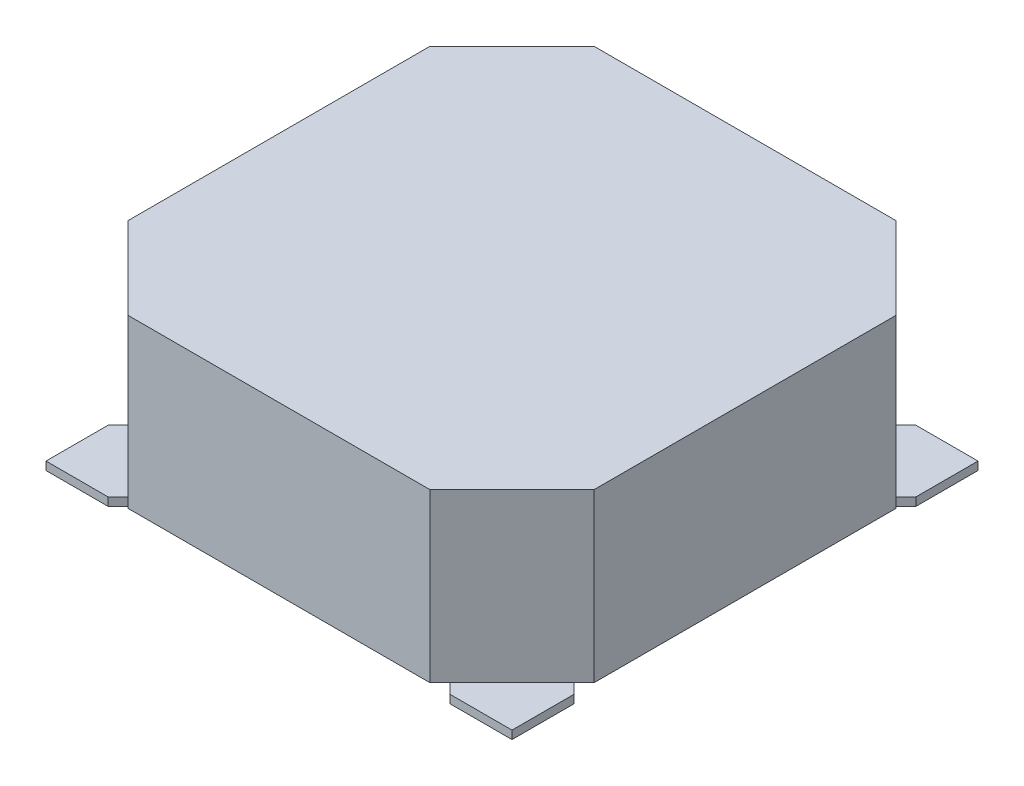
ISO-10303-21;
HEADER;
FILE_DESCRIPTION(('STEP AP214'),'2;1');
FILE_NAME('part.step','',(''),(''),'','','');
FILE_SCHEMA(('AUTOMOTIVE_DESIGN { 1 0 10303 214 1 1 1 1 }'));
ENDSEC;
DATA;
#1=APPLICATION_CONTEXT('core data for automotive mechanical design processes');
#2=APPLICATION_PROTOCOL_DEFINITION('international standard','automotive_design',2000,#1);
#3=PRODUCT_CONTEXT('',#1,'mechanical');
#4=PRODUCT('Part','Part','',(#3));
#5=PRODUCT_RELATED_PRODUCT_CATEGORY('part','',(#4));
#6=PRODUCT_DEFINITION_FORMATION('','',#4);
#7=PRODUCT_DEFINITION_CONTEXT('part definition',#1,'design');
#8=PRODUCT_DEFINITION('design','',#6,#7);
#9=PRODUCT_DEFINITION_SHAPE('','',#8);
#10=(LENGTH_UNIT() NAMED_UNIT(*) SI_UNIT(.MILLI.,.METRE.));
#11=(NAMED_UNIT(*) PLANE_ANGLE_UNIT() SI_UNIT($,.RADIAN.));
#12=(NAMED_UNIT(*) SI_UNIT($,.STERADIAN.) SOLID_ANGLE_UNIT());
#13=UNCERTAINTY_MEASURE_WITH_UNIT(LENGTH_MEASURE(1.E-05),#10,'distance_accuracy_value','');
#14=(GEOMETRIC_REPRESENTATION_CONTEXT(3) GLOBAL_UNCERTAINTY_ASSIGNED_CONTEXT((#13)) GLOBAL_UNIT_ASSIGNED_CONTEXT((#10,
#11,#12)) REPRESENTATION_CONTEXT('',''));
#15=CARTESIAN_POINT('',(0.,0.,0.));
#16=DIRECTION('',(0.,0.,1.));
#17=DIRECTION('',(1.,0.,0.));
#18=AXIS2_PLACEMENT_3D('',#15,#16,#17);
#19=CARTESIAN_POINT('',(0.,3.2,0.));
#20=DIRECTION('',(1.,0.,0.));
#21=DIRECTION('',(0.,0.,-1.));
#22=AXIS2_PLACEMENT_3D('',#19,#20,#21);
#23=PLANE('',#22);
#24=DIRECTION('',(0.,1.,0.));
#25=VECTOR('',#24,1.);
#26=CARTESIAN_POINT('',(0.,0.15,1.5));
#27=LINE('',#26,#25);
#28=CARTESIAN_POINT('',(0.,0.150000000000001,1.5));
#29=VERTEX_POINT('',#28);
#30=CARTESIAN_POINT('',(0.,3.2,1.5));
#31=VERTEX_POINT('',#30);
#32=EDGE_CURVE('E294',#29,#31,#27,.T.);
#33=ORIENTED_EDGE('',*,*,#32,.F.);
#34=DIRECTION('',(0.,0.,-1.));
#35=VECTOR('',#34,1.);
#36=CARTESIAN_POINT('',(0.,0.150000000000001,1.13137084989849));
#37=LINE('',#36,#35);
#38=CARTESIAN_POINT('',(0.,0.150000000000001,7.));
#39=VERTEX_POINT('',#38);
#40=EDGE_CURVE('E443',#39,#29,#37,.T.);
#41=ORIENTED_EDGE('',*,*,#40,.F.);
#42=DIRECTION('',(0.,1.,0.));
#43=VECTOR('',#42,1.);
#44=CARTESIAN_POINT('',(0.,0.15,7.));
#45=LINE('',#44,#43);
#46=CARTESIAN_POINT('',(0.,3.2,7.));
#47=VERTEX_POINT('',#46);
#48=EDGE_CURVE('E338',#39,#47,#45,.T.);
#49=ORIENTED_EDGE('',*,*,#48,.T.);
#50=DIRECTION('',(0.,0.,1.));
#51=VECTOR('',#50,1.);
#52=CARTESIAN_POINT('',(0.,3.2,0.));
#53=LINE('',#52,#51);
#54=EDGE_CURVE('E346',#31,#47,#53,.T.);
#55=ORIENTED_EDGE('',*,*,#54,.F.);
#56=EDGE_LOOP('',(#33,#41,#49,#55));
#57=FACE_BOUND('',#56,.T.);
#58=ADVANCED_FACE('F32',(#57),#23,.F.);
#59=DIRECTION('',(0.,0.,1.));
#60=VECTOR('',#59,1.);
#61=CARTESIAN_POINT('',(0.,0.15,0.));
#62=LINE('',#61,#60);
#63=CARTESIAN_POINT('',(0.,0.150000000000001,7.36862915010156));
#64=VERTEX_POINT('',#63);
#65=CARTESIAN_POINT('',(0.,0.15,8.5));
#66=VERTEX_POINT('',#65);
#67=EDGE_CURVE('E332',#64,#66,#62,.T.);
#68=ORIENTED_EDGE('',*,*,#67,.F.);
#69=DIRECTION('',(0.,-1.,0.));
#70=VECTOR('',#69,1.);
#71=CARTESIAN_POINT('',(0.,12.1708152801714,7.36862915010156));
#72=LINE('',#71,#70);
#73=CARTESIAN_POINT('',(0.,0.,7.36862915010156));
#74=VERTEX_POINT('',#73);
#75=EDGE_CURVE('E446',#64,#74,#72,.T.);
#76=ORIENTED_EDGE('',*,*,#75,.T.);
#77=DIRECTION('',(0.,0.,1.));
#78=VECTOR('',#77,1.);
#79=CARTESIAN_POINT('',(0.,0.,0.));
#80=LINE('',#79,#78);
#81=CARTESIAN_POINT('',(0.,0.,8.5));
#82=VERTEX_POINT('',#81);
#83=EDGE_CURVE('E343',#74,#82,#80,.T.);
#84=ORIENTED_EDGE('',*,*,#83,.T.);
#85=DIRECTION('',(0.,-1.,0.));
#86=VECTOR('',#85,1.);
#87=CARTESIAN_POINT('',(0.,3.2,8.5));
#88=LINE('',#87,#86);
#89=EDGE_CURVE('E40',#66,#82,#88,.T.);
#90=ORIENTED_EDGE('',*,*,#89,.F.);
#91=EDGE_LOOP('',(#68,#76,#84,#90));
#92=FACE_BOUND('',#91,.T.);
#93=ADVANCED_FACE('F528',(#92),#23,.F.);
#94=CARTESIAN_POINT('',(0.,3.2,8.5));
#95=DIRECTION('',(0.,0.,-1.));
#96=DIRECTION('',(-1.,0.,0.));
#97=AXIS2_PLACEMENT_3D('',#94,#95,#96);
#98=PLANE('',#97);
#99=DIRECTION('',(0.,1.,0.));
#100=VECTOR('',#99,1.);
#101=CARTESIAN_POINT('',(1.5,0.15,8.5));
#102=LINE('',#101,#100);
#103=CARTESIAN_POINT('',(1.5,0.150000000000001,8.50000000000002));
#104=VERTEX_POINT('',#103);
#105=CARTESIAN_POINT('',(1.5,3.2,8.5));
#106=VERTEX_POINT('',#105);
#107=EDGE_CURVE('E341',#104,#106,#102,.T.);
#108=ORIENTED_EDGE('',*,*,#107,.F.);
#109=DIRECTION('',(-1.,0.,0.));
#110=VECTOR('',#109,1.);
#111=CARTESIAN_POINT('',(1.13137084989851,0.150000000000001,8.50000000000002));
#112=LINE('',#111,#110);
#113=CARTESIAN_POINT('',(7.,0.150000000000001,8.49999999999998));
#114=VERTEX_POINT('',#113);
#115=EDGE_CURVE('E460',#114,#104,#112,.T.);
#116=ORIENTED_EDGE('',*,*,#115,.F.);
#117=DIRECTION('',(0.,1.,0.));
#118=VECTOR('',#117,1.);
#119=CARTESIAN_POINT('',(7.,0.15,8.5));
#120=LINE('',#119,#118);
#121=CARTESIAN_POINT('',(7.,3.2,8.5));
#122=VERTEX_POINT('',#121);
#123=EDGE_CURVE('E323',#114,#122,#120,.T.);
#124=ORIENTED_EDGE('',*,*,#123,.T.);
#125=DIRECTION('',(1.,0.,0.));
#126=VECTOR('',#125,1.);
#127=CARTESIAN_POINT('',(0.,3.2,8.5));
#128=LINE('',#127,#126);
#129=EDGE_CURVE('E348',#106,#122,#128,.T.);
#130=ORIENTED_EDGE('',*,*,#129,.F.);
#131=EDGE_LOOP('',(#108,#116,#124,#130));
#132=FACE_BOUND('',#131,.T.);
#133=ADVANCED_FACE('F501',(#132),#98,.F.);
#134=DIRECTION('',(1.,0.,0.));
#135=VECTOR('',#134,1.);
#136=CARTESIAN_POINT('',(0.,0.15,8.5));
#137=LINE('',#136,#135);
#138=CARTESIAN_POINT('',(7.36862915010158,0.15,8.5));
#139=VERTEX_POINT('',#138);
#140=CARTESIAN_POINT('',(8.5,0.15,8.5));
#141=VERTEX_POINT('',#140);
#142=EDGE_CURVE('E53',#139,#141,#137,.T.);
#143=ORIENTED_EDGE('',*,*,#142,.F.);
#144=DIRECTION('',(0.,-1.,0.));
#145=VECTOR('',#144,1.);
#146=CARTESIAN_POINT('',(7.36862915010158,12.1708152801714,8.49999999999997));
#147=LINE('',#146,#145);
#148=CARTESIAN_POINT('',(7.36862915010158,0.,8.49999999999997));
#149=VERTEX_POINT('',#148);
#150=EDGE_CURVE('E46',#139,#149,#147,.T.);
#151=ORIENTED_EDGE('',*,*,#150,.T.);
#152=DIRECTION('',(1.,0.,0.));
#153=VECTOR('',#152,1.);
#154=CARTESIAN_POINT('',(0.,0.,8.5));
#155=LINE('',#154,#153);
#156=CARTESIAN_POINT('',(8.5,0.,8.5));
#157=VERTEX_POINT('',#156);
#158=EDGE_CURVE('E362',#149,#157,#155,.T.);
#159=ORIENTED_EDGE('',*,*,#158,.T.);
#160=DIRECTION('',(0.,-1.,0.));
#161=VECTOR('',#160,1.);
#162=CARTESIAN_POINT('',(8.5,3.2,8.5));
#163=LINE('',#162,#161);
#164=EDGE_CURVE('E378',#141,#157,#163,.T.);
#165=ORIENTED_EDGE('',*,*,#164,.F.);
#166=EDGE_LOOP('',(#143,#151,#159,#165));
#167=FACE_BOUND('',#166,.T.);
#168=ADVANCED_FACE('F481',(#167),#98,.F.);
#169=CARTESIAN_POINT('',(8.5,3.2,0.));
#170=DIRECTION('',(-1.,0.,0.));
#171=DIRECTION('',(0.,0.,1.));
#172=AXIS2_PLACEMENT_3D('',#169,#170,#171);
#173=PLANE('',#172);
#174=DIRECTION('',(0.,1.,0.));
#175=VECTOR('',#174,1.);
#176=CARTESIAN_POINT('',(8.5,0.15,7.));
#177=LINE('',#176,#175);
#178=CARTESIAN_POINT('',(8.50000000000003,0.150000000000001,7.));
#179=VERTEX_POINT('',#178);
#180=CARTESIAN_POINT('',(8.5,3.2,7.));
#181=VERTEX_POINT('',#180);
#182=EDGE_CURVE('E312',#179,#181,#177,.T.);
#183=ORIENTED_EDGE('',*,*,#182,.F.);
#184=DIRECTION('',(0.,0.,1.));
#185=VECTOR('',#184,1.);
#186=CARTESIAN_POINT('',(8.50000000000003,0.150000000000001,7.36862915010148));
#187=LINE('',#186,#185);
#188=CARTESIAN_POINT('',(8.50000000000001,0.150000000000001,1.5));
#189=VERTEX_POINT('',#188);
#190=EDGE_CURVE('E273',#189,#179,#187,.T.);
#191=ORIENTED_EDGE('',*,*,#190,.F.);
#192=DIRECTION('',(0.,1.,0.));
#193=VECTOR('',#192,1.);
#194=CARTESIAN_POINT('',(8.5,0.15,1.5));
#195=LINE('',#194,#193);
#196=CARTESIAN_POINT('',(8.5,3.2,1.5));
#197=VERTEX_POINT('',#196);
#198=EDGE_CURVE('E308',#189,#197,#195,.T.);
#199=ORIENTED_EDGE('',*,*,#198,.T.);
#200=DIRECTION('',(0.,0.,-1.));
#201=VECTOR('',#200,1.);
#202=CARTESIAN_POINT('',(8.5,3.2,0.));
#203=LINE('',#202,#201);
#204=EDGE_CURVE('E352',#181,#197,#203,.T.);
#205=ORIENTED_EDGE('',*,*,#204,.F.);
#206=EDGE_LOOP('',(#183,#191,#199,#205));
#207=FACE_BOUND('',#206,.T.);
#208=ADVANCED_FACE('F662',(#207),#173,.F.);
#209=DIRECTION('',(0.,0.,-1.));
#210=VECTOR('',#209,1.);
#211=CARTESIAN_POINT('',(8.5,0.,0.));
#212=LINE('',#211,#210);
#213=CARTESIAN_POINT('',(8.50000000000003,0.,7.36862915010148));
#214=VERTEX_POINT('',#213);
#215=EDGE_CURVE('E367',#157,#214,#212,.T.);
#216=ORIENTED_EDGE('',*,*,#215,.T.);
#217=DIRECTION('',(0.,-1.,0.));
#218=VECTOR('',#217,1.);
#219=CARTESIAN_POINT('',(8.50000000000003,12.1708152801714,7.36862915010148));
#220=LINE('',#219,#218);
#221=CARTESIAN_POINT('',(8.50000000000003,0.150000000000001,7.36862915010148));
#222=VERTEX_POINT('',#221);
#223=EDGE_CURVE('E270',#222,#214,#220,.T.);
#224=ORIENTED_EDGE('',*,*,#223,.F.);
#225=DIRECTION('',(0.,0.,-1.));
#226=VECTOR('',#225,1.);
#227=CARTESIAN_POINT('',(8.5,0.15,0.));
#228=LINE('',#227,#226);
#229=EDGE_CURVE('E321',#141,#222,#228,.T.);
#230=ORIENTED_EDGE('',*,*,#229,.F.);
#231=ORIENTED_EDGE('',*,*,#164,.T.);
#232=EDGE_LOOP('',(#216,#224,#230,#231));
#233=FACE_BOUND('',#232,.T.);
#234=ADVANCED_FACE('F489',(#233),#173,.F.);
#235=CARTESIAN_POINT('',(0.,3.2,0.));
#236=DIRECTION('',(0.,0.,1.));
#237=DIRECTION('',(1.,0.,0.));
#238=AXIS2_PLACEMENT_3D('',#235,#236,#237);
#239=PLANE('',#238);
#240=DIRECTION('',(0.,1.,0.));
#241=VECTOR('',#240,1.);
#242=CARTESIAN_POINT('',(7.00000000000001,0.15,0.));
#243=LINE('',#242,#241);
#244=CARTESIAN_POINT('',(7.00000000000001,0.150000000000001,0.));
#245=VERTEX_POINT('',#244);
#246=CARTESIAN_POINT('',(7.00000000000001,3.2,0.));
#247=VERTEX_POINT('',#246);
#248=EDGE_CURVE('E293',#245,#247,#243,.T.);
#249=ORIENTED_EDGE('',*,*,#248,.F.);
#250=DIRECTION('',(1.,0.,0.));
#251=VECTOR('',#250,1.);
#252=CARTESIAN_POINT('',(7.36862915010152,0.150000000000001,0.));
#253=LINE('',#252,#251);
#254=CARTESIAN_POINT('',(1.49999999999999,0.150000000000001,0.));
#255=VERTEX_POINT('',#254);
#256=EDGE_CURVE('E426',#255,#245,#253,.T.);
#257=ORIENTED_EDGE('',*,*,#256,.F.);
#258=DIRECTION('',(0.,1.,0.));
#259=VECTOR('',#258,1.);
#260=CARTESIAN_POINT('',(1.49999999999999,0.15,0.));
#261=LINE('',#260,#259);
#262=CARTESIAN_POINT('',(1.49999999999999,3.2,0.));
#263=VERTEX_POINT('',#262);
#264=EDGE_CURVE('E289',#255,#263,#261,.T.);
#265=ORIENTED_EDGE('',*,*,#264,.T.);
#266=DIRECTION('',(-1.,0.,0.));
#267=VECTOR('',#266,1.);
#268=CARTESIAN_POINT('',(0.,3.2,0.));
#269=LINE('',#268,#267);
#270=EDGE_CURVE('E355',#247,#263,#269,.T.);
#271=ORIENTED_EDGE('',*,*,#270,.F.);
#272=EDGE_LOOP('',(#249,#257,#265,#271));
#273=FACE_BOUND('',#272,.T.);
#274=ADVANCED_FACE('F659',(#273),#239,.F.);
#275=DIRECTION('',(-1.,0.,0.));
#276=VECTOR('',#275,1.);
#277=CARTESIAN_POINT('',(0.,0.15,0.));
#278=LINE('',#277,#276);
#279=CARTESIAN_POINT('',(1.13137084989845,0.150000000000001,0.));
#280=VERTEX_POINT('',#279);
#281=CARTESIAN_POINT('',(0.,0.15,0.));
#282=VERTEX_POINT('',#281);
#283=EDGE_CURVE('E283',#280,#282,#278,.T.);
#284=ORIENTED_EDGE('',*,*,#283,.F.);
#285=DIRECTION('',(0.,-1.,0.));
#286=VECTOR('',#285,1.);
#287=CARTESIAN_POINT('',(1.13137084989845,12.1708152801714,0.));
#288=LINE('',#287,#286);
#289=CARTESIAN_POINT('',(1.13137084989845,0.,0.));
#290=VERTEX_POINT('',#289);
#291=EDGE_CURVE('E429',#280,#290,#288,.T.);
#292=ORIENTED_EDGE('',*,*,#291,.T.);
#293=DIRECTION('',(-1.,0.,0.));
#294=VECTOR('',#293,1.);
#295=CARTESIAN_POINT('',(0.,0.,0.));
#296=LINE('',#295,#294);
#297=CARTESIAN_POINT('',(0.,0.,0.));
#298=VERTEX_POINT('',#297);
#299=EDGE_CURVE('E370',#290,#298,#296,.T.);
#300=ORIENTED_EDGE('',*,*,#299,.T.);
#301=DIRECTION('',(0.,-1.,0.));
#302=VECTOR('',#301,1.);
#303=CARTESIAN_POINT('',(0.,3.2,0.));
#304=LINE('',#303,#302);
#305=EDGE_CURVE('E358',#282,#298,#304,.T.);
#306=ORIENTED_EDGE('',*,*,#305,.F.);
#307=EDGE_LOOP('',(#284,#292,#300,#306));
#308=FACE_BOUND('',#307,.T.);
#309=ADVANCED_FACE('F660',(#308),#239,.F.);
#310=CARTESIAN_POINT('',(0.,0.,0.));
#311=DIRECTION('',(0.,1.,0.));
#312=DIRECTION('',(0.,0.,1.));
#313=AXIS2_PLACEMENT_3D('',#310,#311,#312);
#314=PLANE('',#313);
#315=DIRECTION('',(-0.707106781186536,0.,0.707106781186559));
#316=VECTOR('',#315,1.);
#317=CARTESIAN_POINT('',(6.83829906421165,0.,7.96966991411007));
#318=LINE('',#317,#316);
#319=CARTESIAN_POINT('',(7.96966991411011,0.,6.83829906421157));
#320=VERTEX_POINT('',#319);
#321=CARTESIAN_POINT('',(6.83829906421165,0.,7.96966991411007));
#322=VERTEX_POINT('',#321);
#323=EDGE_CURVE('E405',#320,#322,#318,.T.);
#324=ORIENTED_EDGE('',*,*,#323,.F.);
#325=DIRECTION('',(-0.707106781186558,0.,-0.707106781186537));
#326=VECTOR('',#325,1.);
#327=CARTESIAN_POINT('',(7.96966991411011,0.,6.83829906421157));
#328=LINE('',#327,#326);
#329=EDGE_CURVE('E264',#214,#320,#328,.T.);
#330=ORIENTED_EDGE('',*,*,#329,.F.);
#331=ORIENTED_EDGE('',*,*,#215,.F.);
#332=ORIENTED_EDGE('',*,*,#158,.F.);
#333=DIRECTION('',(0.70710678118656,0.,0.707106781186535));
#334=VECTOR('',#333,1.);
#335=CARTESIAN_POINT('',(7.36862915010158,0.,8.49999999999997));
#336=LINE('',#335,#334);
#337=EDGE_CURVE('E401',#322,#149,#336,.T.);
#338=ORIENTED_EDGE('',*,*,#337,.F.);
#339=EDGE_LOOP('',(#324,#330,#331,#332,#338));
#340=FACE_BOUND('',#339,.T.);
#341=ADVANCED_FACE('F486',(#340),#314,.F.);
#342=DIRECTION('',(-0.707106781186556,0.,-0.707106781186539));
#343=VECTOR('',#342,1.);
#344=CARTESIAN_POINT('',(0.530330085889919,0.,6.83829906421164));
#345=LINE('',#344,#343);
#346=CARTESIAN_POINT('',(1.66170093578841,0.,7.96966991411011));
#347=VERTEX_POINT('',#346);
#348=CARTESIAN_POINT('',(0.530330085889919,0.,6.83829906421164));
#349=VERTEX_POINT('',#348);
#350=EDGE_CURVE('E398',#347,#349,#345,.T.);
#351=ORIENTED_EDGE('',*,*,#350,.F.);
#352=DIRECTION('',(0.707106781186539,0.,-0.707106781186556));
#353=VECTOR('',#352,1.);
#354=CARTESIAN_POINT('',(1.66170093578841,0.,7.96966991411011));
#355=LINE('',#354,#353);
#356=CARTESIAN_POINT('',(1.13137084989851,0.,8.50000000000002));
#357=VERTEX_POINT('',#356);
#358=EDGE_CURVE('E396',#357,#347,#355,.T.);
#359=ORIENTED_EDGE('',*,*,#358,.F.);
#360=EDGE_CURVE('E363',#82,#357,#155,.T.);
#361=ORIENTED_EDGE('',*,*,#360,.F.);
#362=ORIENTED_EDGE('',*,*,#83,.F.);
#363=DIRECTION('',(-0.707106781186537,0.,0.707106781186558));
#364=VECTOR('',#363,1.);
#365=CARTESIAN_POINT('',(0.,0.,7.36862915010156));
#366=LINE('',#365,#364);
#367=EDGE_CURVE('E403',#349,#74,#366,.T.);
#368=ORIENTED_EDGE('',*,*,#367,.F.);
#369=EDGE_LOOP('',(#351,#359,#361,#362,#368));
#370=FACE_BOUND('',#369,.T.);
#371=ADVANCED_FACE('F393',(#370),#314,.F.);
#372=DIRECTION('',(0.707106781186541,0.,-0.707106781186554));
#373=VECTOR('',#372,1.);
#374=CARTESIAN_POINT('',(1.66170093578837,0.,0.530330085889912));
#375=LINE('',#374,#373);
#376=CARTESIAN_POINT('',(0.530330085889905,0.,1.6617009357884));
#377=VERTEX_POINT('',#376);
#378=CARTESIAN_POINT('',(1.66170093578837,0.,0.530330085889912));
#379=VERTEX_POINT('',#378);
#380=EDGE_CURVE('E554',#377,#379,#375,.T.);
#381=ORIENTED_EDGE('',*,*,#380,.F.);
#382=DIRECTION('',(0.707106781186553,0.,0.707106781186542));
#383=VECTOR('',#382,1.);
#384=CARTESIAN_POINT('',(0.530330085889905,0.,1.6617009357884));
#385=LINE('',#384,#383);
#386=CARTESIAN_POINT('',(0.,0.,1.13137084989849));
#387=VERTEX_POINT('',#386);
#388=EDGE_CURVE('E527',#387,#377,#385,.T.);
#389=ORIENTED_EDGE('',*,*,#388,.F.);
#390=EDGE_CURVE('E359',#298,#387,#80,.T.);
#391=ORIENTED_EDGE('',*,*,#390,.F.);
#392=ORIENTED_EDGE('',*,*,#299,.F.);
#393=DIRECTION('',(-0.707106781186556,0.,-0.707106781186539));
#394=VECTOR('',#393,1.);
#395=CARTESIAN_POINT('',(1.13137084989845,0.,0.));
#396=LINE('',#395,#394);
#397=EDGE_CURVE('E558',#379,#290,#396,.T.);
#398=ORIENTED_EDGE('',*,*,#397,.F.);
#399=EDGE_LOOP('',(#381,#389,#391,#392,#398));
#400=FACE_BOUND('',#399,.T.);
#401=ADVANCED_FACE('F535',(#400),#314,.F.);
#402=ORIENTED_EDGE('',*,*,#390,.T.);
#403=DIRECTION('',(0.,-1.,0.));
#404=VECTOR('',#403,1.);
#405=CARTESIAN_POINT('',(0.,12.1708152801714,1.13137084989849));
#406=LINE('',#405,#404);
#407=CARTESIAN_POINT('',(0.,0.150000000000001,1.13137084989849));
#408=VERTEX_POINT('',#407);
#409=EDGE_CURVE('E445',#408,#387,#406,.T.);
#410=ORIENTED_EDGE('',*,*,#409,.F.);
#411=DIRECTION('',(0.,0.,1.));
#412=VECTOR('',#411,1.);
#413=CARTESIAN_POINT('',(0.,0.15,0.));
#414=LINE('',#413,#412);
#415=EDGE_CURVE('E286',#282,#408,#414,.T.);
#416=ORIENTED_EDGE('',*,*,#415,.F.);
#417=ORIENTED_EDGE('',*,*,#305,.T.);
#418=EDGE_LOOP('',(#402,#410,#416,#417));
#419=FACE_BOUND('',#418,.T.);
#420=ADVANCED_FACE('F34',(#419),#23,.F.);
#421=ORIENTED_EDGE('',*,*,#360,.T.);
#422=DIRECTION('',(0.,-1.,0.));
#423=VECTOR('',#422,1.);
#424=CARTESIAN_POINT('',(1.13137084989851,12.1708152801714,8.50000000000002));
#425=LINE('',#424,#423);
#426=CARTESIAN_POINT('',(1.13137084989851,0.150000000000001,8.50000000000002));
#427=VERTEX_POINT('',#426);
#428=EDGE_CURVE('E462',#427,#357,#425,.T.);
#429=ORIENTED_EDGE('',*,*,#428,.F.);
#430=DIRECTION('',(1.,0.,0.));
#431=VECTOR('',#430,1.);
#432=CARTESIAN_POINT('',(0.,0.15,8.5));
#433=LINE('',#432,#431);
#434=EDGE_CURVE('E335',#66,#427,#433,.T.);
#435=ORIENTED_EDGE('',*,*,#434,.F.);
#436=ORIENTED_EDGE('',*,*,#89,.T.);
#437=EDGE_LOOP('',(#421,#429,#435,#436));
#438=FACE_BOUND('',#437,.T.);
#439=ADVANCED_FACE('F385',(#438),#98,.F.);
#440=CARTESIAN_POINT('',(0.,3.2,0.));
#441=DIRECTION('',(0.,1.,0.));
#442=DIRECTION('',(0.,0.,1.));
#443=AXIS2_PLACEMENT_3D('',#440,#441,#442);
#444=PLANE('',#443);
#445=ORIENTED_EDGE('',*,*,#270,.T.);
#446=DIRECTION('',(-0.707106781186546,0.,0.707106781186549));
#447=VECTOR('',#446,1.);
#448=CARTESIAN_POINT('',(0.75,3.2,0.749999999999997));
#449=LINE('',#448,#447);
#450=EDGE_CURVE('E290',#263,#31,#449,.T.);
#451=ORIENTED_EDGE('',*,*,#450,.T.);
#452=ORIENTED_EDGE('',*,*,#54,.T.);
#453=DIRECTION('',(0.707106781186547,0.,0.707106781186548));
#454=VECTOR('',#453,1.);
#455=CARTESIAN_POINT('',(-3.5,3.2,3.49999999999999));
#456=LINE('',#455,#454);
#457=EDGE_CURVE('E296',#47,#106,#456,.T.);
#458=ORIENTED_EDGE('',*,*,#457,.T.);
#459=ORIENTED_EDGE('',*,*,#129,.T.);
#460=DIRECTION('',(0.707106781186549,0.,-0.707106781186546));
#461=VECTOR('',#460,1.);
#462=CARTESIAN_POINT('',(7.74999999999999,3.2,7.75000000000002));
#463=LINE('',#462,#461);
#464=EDGE_CURVE('E279',#122,#181,#463,.T.);
#465=ORIENTED_EDGE('',*,*,#464,.T.);
#466=ORIENTED_EDGE('',*,*,#204,.T.);
#467=DIRECTION('',(-0.707106781186546,0.,-0.707106781186549));
#468=VECTOR('',#467,1.);
#469=CARTESIAN_POINT('',(3.50000000000001,3.2,-3.5));
#470=LINE('',#469,#468);
#471=EDGE_CURVE('E309',#197,#247,#470,.T.);
#472=ORIENTED_EDGE('',*,*,#471,.T.);
#473=EDGE_LOOP('',(#445,#451,#452,#458,#459,#465,#466,#472));
#474=FACE_BOUND('',#473,.T.);
#475=ADVANCED_FACE('F509',(#474),#444,.T.);
#476=DIRECTION('',(0.,0.,-1.));
#477=VECTOR('',#476,1.);
#478=CARTESIAN_POINT('',(8.5,0.15,0.));
#479=LINE('',#478,#477);
#480=CARTESIAN_POINT('',(8.5,0.150000000000001,1.13137084989847));
#481=VERTEX_POINT('',#480);
#482=CARTESIAN_POINT('',(8.5,0.15,0.));
#483=VERTEX_POINT('',#482);
#484=EDGE_CURVE('E302',#481,#483,#479,.T.);
#485=ORIENTED_EDGE('',*,*,#484,.F.);
#486=DIRECTION('',(0.,-1.,0.));
#487=VECTOR('',#486,1.);
#488=CARTESIAN_POINT('',(8.5,12.1708152801714,1.13137084989847));
#489=LINE('',#488,#487);
#490=CARTESIAN_POINT('',(8.5,0.,1.13137084989847));
#491=VERTEX_POINT('',#490);
#492=EDGE_CURVE('E412',#481,#491,#489,.T.);
#493=ORIENTED_EDGE('',*,*,#492,.T.);
#494=CARTESIAN_POINT('',(8.5,0.,0.));
#495=VERTEX_POINT('',#494);
#496=EDGE_CURVE('E366',#491,#495,#212,.T.);
#497=ORIENTED_EDGE('',*,*,#496,.T.);
#498=DIRECTION('',(0.,-1.,0.));
#499=VECTOR('',#498,1.);
#500=CARTESIAN_POINT('',(8.5,3.2,0.));
#501=LINE('',#500,#499);
#502=EDGE_CURVE('E375',#483,#495,#501,.T.);
#503=ORIENTED_EDGE('',*,*,#502,.F.);
#504=EDGE_LOOP('',(#485,#493,#497,#503));
#505=FACE_BOUND('',#504,.T.);
#506=ADVANCED_FACE('F578',(#505),#173,.F.);
#507=CARTESIAN_POINT('',(7.36862915010152,0.,0.));
#508=VERTEX_POINT('',#507);
#509=EDGE_CURVE('E349',#495,#508,#296,.T.);
#510=ORIENTED_EDGE('',*,*,#509,.T.);
#511=DIRECTION('',(0.,-1.,0.));
#512=VECTOR('',#511,1.);
#513=CARTESIAN_POINT('',(7.36862915010152,12.1708152801714,0.));
#514=LINE('',#513,#512);
#515=CARTESIAN_POINT('',(7.36862915010152,0.150000000000001,0.));
#516=VERTEX_POINT('',#515);
#517=EDGE_CURVE('E428',#516,#508,#514,.T.);
#518=ORIENTED_EDGE('',*,*,#517,.F.);
#519=DIRECTION('',(-1.,0.,0.));
#520=VECTOR('',#519,1.);
#521=CARTESIAN_POINT('',(0.,0.15,0.));
#522=LINE('',#521,#520);
#523=EDGE_CURVE('E305',#483,#516,#522,.T.);
#524=ORIENTED_EDGE('',*,*,#523,.F.);
#525=ORIENTED_EDGE('',*,*,#502,.T.);
#526=EDGE_LOOP('',(#510,#518,#524,#525));
#527=FACE_BOUND('',#526,.T.);
#528=ADVANCED_FACE('F584',(#527),#239,.F.);
#529=DIRECTION('',(0.707106781186551,0.,0.707106781186544));
#530=VECTOR('',#529,1.);
#531=CARTESIAN_POINT('',(7.9696699141101,0.,1.66170093578838));
#532=LINE('',#531,#530);
#533=CARTESIAN_POINT('',(6.83829906421161,0.,0.530330085889912));
#534=VERTEX_POINT('',#533);
#535=CARTESIAN_POINT('',(7.9696699141101,0.,1.66170093578838));
#536=VERTEX_POINT('',#535);
#537=EDGE_CURVE('E565',#534,#536,#532,.T.);
#538=ORIENTED_EDGE('',*,*,#537,.F.);
#539=DIRECTION('',(-0.707106781186544,0.,0.707106781186551));
#540=VECTOR('',#539,1.);
#541=CARTESIAN_POINT('',(6.83829906421161,0.,0.530330085889912));
#542=LINE('',#541,#540);
#543=EDGE_CURVE('E562',#508,#534,#542,.T.);
#544=ORIENTED_EDGE('',*,*,#543,.F.);
#545=ORIENTED_EDGE('',*,*,#509,.F.);
#546=ORIENTED_EDGE('',*,*,#496,.F.);
#547=DIRECTION('',(0.707106781186545,0.,-0.707106781186549));
#548=VECTOR('',#547,1.);
#549=CARTESIAN_POINT('',(8.5,0.,1.13137084989847));
#550=LINE('',#549,#548);
#551=EDGE_CURVE('E252',#536,#491,#550,.T.);
#552=ORIENTED_EDGE('',*,*,#551,.F.);
#553=EDGE_LOOP('',(#538,#544,#545,#546,#552));
#554=FACE_BOUND('',#553,.T.);
#555=ADVANCED_FACE('F543',(#554),#314,.F.);
#556=CARTESIAN_POINT('',(-3.5,0.15,3.49999999999999));
#557=DIRECTION('',(-0.707106781186548,0.,0.707106781186547));
#558=DIRECTION('',(0.707106781186547,0.,0.707106781186548));
#559=AXIS2_PLACEMENT_3D('',#556,#557,#558);
#560=PLANE('',#559);
#561=ORIENTED_EDGE('',*,*,#457,.F.);
#562=ORIENTED_EDGE('',*,*,#48,.F.);
#563=DIRECTION('',(0.707106781186547,0.,0.707106781186548));
#564=VECTOR('',#563,1.);
#565=CARTESIAN_POINT('',(-3.5,0.15,3.49999999999999));
#566=LINE('',#565,#564);
#567=CARTESIAN_POINT('',(0.184314575050787,0.150000000000001,7.18431457505079));
#568=VERTEX_POINT('',#567);
#569=EDGE_CURVE('E329',#39,#568,#566,.T.);
#570=ORIENTED_EDGE('',*,*,#569,.T.);
#571=CARTESIAN_POINT('',(1.31568542494926,0.150000000000001,8.31568542494927));
#572=VERTEX_POINT('',#571);
#573=EDGE_CURVE('E333',#568,#572,#566,.T.);
#574=ORIENTED_EDGE('',*,*,#573,.T.);
#575=DIRECTION('',(-0.707106781186547,0.,-0.707106781186548));
#576=VECTOR('',#575,1.);
#577=CARTESIAN_POINT('',(-3.5,0.15,3.49999999999999));
#578=LINE('',#577,#576);
#579=EDGE_CURVE('E277',#104,#572,#578,.T.);
#580=ORIENTED_EDGE('',*,*,#579,.F.);
#581=ORIENTED_EDGE('',*,*,#107,.T.);
#582=EDGE_LOOP('',(#561,#562,#570,#574,#580,#581));
#583=FACE_BOUND('',#582,.T.);
#584=ADVANCED_FACE('F505',(#583),#560,.T.);
#585=CARTESIAN_POINT('',(0.,0.15,0.));
#586=DIRECTION('',(0.,1.,0.));
#587=DIRECTION('',(0.,0.,1.));
#588=AXIS2_PLACEMENT_3D('',#585,#586,#587);
#589=PLANE('',#588);
#590=DIRECTION('',(0.707106781186539,0.,-0.707106781186556));
#591=VECTOR('',#590,1.);
#592=CARTESIAN_POINT('',(1.66170093578841,0.150000000000001,7.96966991411011));
#593=LINE('',#592,#591);
#594=EDGE_CURVE('E456',#427,#572,#593,.T.);
#595=ORIENTED_EDGE('',*,*,#594,.T.);
#596=ORIENTED_EDGE('',*,*,#573,.F.);
#597=DIRECTION('',(-0.707106781186537,0.,0.707106781186558));
#598=VECTOR('',#597,1.);
#599=CARTESIAN_POINT('',(0.,0.150000000000001,7.36862915010156));
#600=LINE('',#599,#598);
#601=EDGE_CURVE('E450',#568,#64,#600,.T.);
#602=ORIENTED_EDGE('',*,*,#601,.T.);
#603=ORIENTED_EDGE('',*,*,#67,.T.);
#604=ORIENTED_EDGE('',*,*,#434,.T.);
#605=EDGE_LOOP('',(#595,#596,#602,#603,#604));
#606=FACE_BOUND('',#605,.T.);
#607=ADVANCED_FACE('F521',(#606),#589,.T.);
#608=CARTESIAN_POINT('',(3.50000000000001,0.15,-3.5));
#609=DIRECTION('',(0.707106781186549,0.,-0.707106781186546));
#610=DIRECTION('',(-0.707106781186546,0.,-0.707106781186549));
#611=AXIS2_PLACEMENT_3D('',#608,#609,#610);
#612=PLANE('',#611);
#613=ORIENTED_EDGE('',*,*,#471,.F.);
#614=ORIENTED_EDGE('',*,*,#198,.F.);
#615=DIRECTION('',(-0.707106781186546,0.,-0.707106781186549));
#616=VECTOR('',#615,1.);
#617=CARTESIAN_POINT('',(3.50000000000001,0.15,-3.5));
#618=LINE('',#617,#616);
#619=CARTESIAN_POINT('',(8.31568542494924,0.150000000000001,1.31568542494924));
#620=VERTEX_POINT('',#619);
#621=EDGE_CURVE('E299',#189,#620,#618,.T.);
#622=ORIENTED_EDGE('',*,*,#621,.T.);
#623=CARTESIAN_POINT('',(7.18431457505077,0.150000000000001,0.184314575050758));
#624=VERTEX_POINT('',#623);
#625=EDGE_CURVE('E303',#620,#624,#618,.T.);
#626=ORIENTED_EDGE('',*,*,#625,.T.);
#627=DIRECTION('',(0.707106781186546,0.,0.707106781186549));
#628=VECTOR('',#627,1.);
#629=CARTESIAN_POINT('',(3.50000000000001,0.15,-3.5));
#630=LINE('',#629,#628);
#631=EDGE_CURVE('E275',#245,#624,#630,.T.);
#632=ORIENTED_EDGE('',*,*,#631,.F.);
#633=ORIENTED_EDGE('',*,*,#248,.T.);
#634=EDGE_LOOP('',(#613,#614,#622,#626,#632,#633));
#635=FACE_BOUND('',#634,.T.);
#636=ADVANCED_FACE('F642',(#635),#612,.T.);
#637=CARTESIAN_POINT('',(0.,0.15,0.));
#638=DIRECTION('',(0.,1.,0.));
#639=DIRECTION('',(0.,0.,1.));
#640=AXIS2_PLACEMENT_3D('',#637,#638,#639);
#641=PLANE('',#640);
#642=DIRECTION('',(-0.707106781186544,0.,0.707106781186551));
#643=VECTOR('',#642,1.);
#644=CARTESIAN_POINT('',(6.83829906421161,0.150000000000001,0.530330085889912));
#645=LINE('',#644,#643);
#646=EDGE_CURVE('E422',#516,#624,#645,.T.);
#647=ORIENTED_EDGE('',*,*,#646,.T.);
#648=ORIENTED_EDGE('',*,*,#625,.F.);
#649=DIRECTION('',(0.707106781186546,0.,-0.70710678118655));
#650=VECTOR('',#649,1.);
#651=CARTESIAN_POINT('',(8.5,0.150000000000001,1.13137084989847));
#652=LINE('',#651,#650);
#653=EDGE_CURVE('E416',#620,#481,#652,.T.);
#654=ORIENTED_EDGE('',*,*,#653,.T.);
#655=ORIENTED_EDGE('',*,*,#484,.T.);
#656=ORIENTED_EDGE('',*,*,#523,.T.);
#657=EDGE_LOOP('',(#647,#648,#654,#655,#656));
#658=FACE_BOUND('',#657,.T.);
#659=ADVANCED_FACE('F587',(#658),#641,.T.);
#660=CARTESIAN_POINT('',(0.75,0.15,0.749999999999997));
#661=DIRECTION('',(-0.707106781186549,0.,-0.707106781186546));
#662=DIRECTION('',(-0.707106781186546,0.,0.707106781186549));
#663=AXIS2_PLACEMENT_3D('',#660,#661,#662);
#664=PLANE('',#663);
#665=ORIENTED_EDGE('',*,*,#450,.F.);
#666=ORIENTED_EDGE('',*,*,#264,.F.);
#667=DIRECTION('',(-0.707106781186546,0.,0.707106781186549));
#668=VECTOR('',#667,1.);
#669=CARTESIAN_POINT('',(0.75,0.15,0.749999999999997));
#670=LINE('',#669,#668);
#671=CARTESIAN_POINT('',(1.31568542494922,0.150000000000001,0.184314575050771));
#672=VERTEX_POINT('',#671);
#673=EDGE_CURVE('E280',#255,#672,#670,.T.);
#674=ORIENTED_EDGE('',*,*,#673,.T.);
#675=CARTESIAN_POINT('',(0.18431457505075,0.150000000000001,1.31568542494925));
#676=VERTEX_POINT('',#675);
#677=EDGE_CURVE('E284',#672,#676,#670,.T.);
#678=ORIENTED_EDGE('',*,*,#677,.T.);
#679=DIRECTION('',(0.707106781186546,0.,-0.707106781186549));
#680=VECTOR('',#679,1.);
#681=CARTESIAN_POINT('',(0.75,0.15,0.749999999999997));
#682=LINE('',#681,#680);
#683=EDGE_CURVE('E272',#29,#676,#682,.T.);
#684=ORIENTED_EDGE('',*,*,#683,.F.);
#685=ORIENTED_EDGE('',*,*,#32,.T.);
#686=EDGE_LOOP('',(#665,#666,#674,#678,#684,#685));
#687=FACE_BOUND('',#686,.T.);
#688=ADVANCED_FACE('F635',(#687),#664,.T.);
#689=CARTESIAN_POINT('',(0.,0.15,0.));
#690=DIRECTION('',(0.,1.,0.));
#691=DIRECTION('',(0.,0.,1.));
#692=AXIS2_PLACEMENT_3D('',#689,#690,#691);
#693=PLANE('',#692);
#694=DIRECTION('',(0.707106781186553,0.,0.707106781186542));
#695=VECTOR('',#694,1.);
#696=CARTESIAN_POINT('',(0.530330085889905,0.150000000000001,1.6617009357884));
#697=LINE('',#696,#695);
#698=EDGE_CURVE('E439',#408,#676,#697,.T.);
#699=ORIENTED_EDGE('',*,*,#698,.T.);
#700=ORIENTED_EDGE('',*,*,#677,.F.);
#701=DIRECTION('',(-0.707106781186556,0.,-0.707106781186539));
#702=VECTOR('',#701,1.);
#703=CARTESIAN_POINT('',(1.13137084989845,0.150000000000001,0.));
#704=LINE('',#703,#702);
#705=EDGE_CURVE('E433',#672,#280,#704,.T.);
#706=ORIENTED_EDGE('',*,*,#705,.T.);
#707=ORIENTED_EDGE('',*,*,#283,.T.);
#708=ORIENTED_EDGE('',*,*,#415,.T.);
#709=EDGE_LOOP('',(#699,#700,#706,#707,#708));
#710=FACE_BOUND('',#709,.T.);
#711=ADVANCED_FACE('F632',(#710),#693,.T.);
#712=CARTESIAN_POINT('',(7.74999999999999,0.15,7.75000000000002));
#713=DIRECTION('',(0.707106781186546,0.,0.707106781186549));
#714=DIRECTION('',(0.707106781186549,0.,-0.707106781186546));
#715=AXIS2_PLACEMENT_3D('',#712,#713,#714);
#716=PLANE('',#715);
#717=ORIENTED_EDGE('',*,*,#464,.F.);
#718=ORIENTED_EDGE('',*,*,#123,.F.);
#719=DIRECTION('',(0.707106781186549,0.,-0.707106781186546));
#720=VECTOR('',#719,1.);
#721=CARTESIAN_POINT('',(7.74999999999999,0.15,7.75000000000002));
#722=LINE('',#721,#720);
#723=CARTESIAN_POINT('',(7.1843145750508,0.150000000000001,8.3156854249492));
#724=VERTEX_POINT('',#723);
#725=EDGE_CURVE('E316',#114,#724,#722,.T.);
#726=ORIENTED_EDGE('',*,*,#725,.T.);
#727=CARTESIAN_POINT('',(8.31568542494928,0.150000000000001,7.18431457505073));
#728=VERTEX_POINT('',#727);
#729=EDGE_CURVE('E319',#724,#728,#722,.T.);
#730=ORIENTED_EDGE('',*,*,#729,.T.);
#731=EDGE_CURVE('E247',#728,#179,#722,.T.);
#732=ORIENTED_EDGE('',*,*,#731,.T.);
#733=ORIENTED_EDGE('',*,*,#182,.T.);
#734=EDGE_LOOP('',(#717,#718,#726,#730,#732,#733));
#735=FACE_BOUND('',#734,.T.);
#736=ADVANCED_FACE('F494',(#735),#716,.T.);
#737=CARTESIAN_POINT('',(0.,0.15,0.));
#738=DIRECTION('',(0.,1.,0.));
#739=DIRECTION('',(0.,0.,1.));
#740=AXIS2_PLACEMENT_3D('',#737,#738,#739);
#741=PLANE('',#740);
#742=DIRECTION('',(-0.707106781186558,0.,-0.707106781186537));
#743=VECTOR('',#742,1.);
#744=CARTESIAN_POINT('',(7.96966991411011,0.150000000000001,6.83829906421157));
#745=LINE('',#744,#743);
#746=EDGE_CURVE('E251',#222,#728,#745,.T.);
#747=ORIENTED_EDGE('',*,*,#746,.T.);
#748=ORIENTED_EDGE('',*,*,#729,.F.);
#749=DIRECTION('',(-0.70710678118656,0.,-0.707106781186535));
#750=VECTOR('',#749,1.);
#751=CARTESIAN_POINT('',(-0.565685424949331,0.15,0.565685424949351));
#752=LINE('',#751,#750);
#753=EDGE_CURVE('E11',#139,#724,#752,.T.);
#754=ORIENTED_EDGE('',*,*,#753,.F.);
#755=ORIENTED_EDGE('',*,*,#142,.T.);
#756=ORIENTED_EDGE('',*,*,#229,.T.);
#757=EDGE_LOOP('',(#747,#748,#754,#755,#756));
#758=FACE_BOUND('',#757,.T.);
#759=ADVANCED_FACE('F490',(#758),#741,.T.);
#760=CARTESIAN_POINT('',(0.,0.15,0.));
#761=DIRECTION('',(0.,1.,0.));
#762=DIRECTION('',(0.,0.,1.));
#763=AXIS2_PLACEMENT_3D('',#760,#761,#762);
#764=PLANE('',#763);
#765=ORIENTED_EDGE('',*,*,#579,.T.);
#766=CARTESIAN_POINT('',(1.66170093578841,0.150000000000001,7.96966991411011));
#767=VERTEX_POINT('',#766);
#768=EDGE_CURVE('E459',#572,#767,#593,.T.);
#769=ORIENTED_EDGE('',*,*,#768,.T.);
#770=DIRECTION('',(-0.707106781186556,0.,-0.707106781186539));
#771=VECTOR('',#770,1.);
#772=CARTESIAN_POINT('',(0.530330085889919,0.150000000000001,6.83829906421164));
#773=LINE('',#772,#771);
#774=CARTESIAN_POINT('',(0.530330085889919,0.150000000000001,6.83829906421164));
#775=VERTEX_POINT('',#774);
#776=EDGE_CURVE('E451',#767,#775,#773,.T.);
#777=ORIENTED_EDGE('',*,*,#776,.T.);
#778=EDGE_CURVE('E447',#775,#568,#600,.T.);
#779=ORIENTED_EDGE('',*,*,#778,.T.);
#780=ORIENTED_EDGE('',*,*,#569,.F.);
#781=ORIENTED_EDGE('',*,*,#40,.T.);
#782=ORIENTED_EDGE('',*,*,#683,.T.);
#783=CARTESIAN_POINT('',(0.530330085889905,0.150000000000001,1.6617009357884));
#784=VERTEX_POINT('',#783);
#785=EDGE_CURVE('E442',#676,#784,#697,.T.);
#786=ORIENTED_EDGE('',*,*,#785,.T.);
#787=DIRECTION('',(0.707106781186541,0.,-0.707106781186554));
#788=VECTOR('',#787,1.);
#789=CARTESIAN_POINT('',(1.66170093578837,0.150000000000001,0.530330085889912));
#790=LINE('',#789,#788);
#791=CARTESIAN_POINT('',(1.66170093578837,0.150000000000001,0.530330085889912));
#792=VERTEX_POINT('',#791);
#793=EDGE_CURVE('E434',#784,#792,#790,.T.);
#794=ORIENTED_EDGE('',*,*,#793,.T.);
#795=EDGE_CURVE('E430',#792,#672,#704,.T.);
#796=ORIENTED_EDGE('',*,*,#795,.T.);
#797=ORIENTED_EDGE('',*,*,#673,.F.);
#798=ORIENTED_EDGE('',*,*,#256,.T.);
#799=ORIENTED_EDGE('',*,*,#631,.T.);
#800=CARTESIAN_POINT('',(6.83829906421161,0.150000000000001,0.530330085889912));
#801=VERTEX_POINT('',#800);
#802=EDGE_CURVE('E425',#624,#801,#645,.T.);
#803=ORIENTED_EDGE('',*,*,#802,.T.);
#804=DIRECTION('',(0.707106781186551,0.,0.707106781186544));
#805=VECTOR('',#804,1.);
#806=CARTESIAN_POINT('',(7.9696699141101,0.150000000000001,1.66170093578838));
#807=LINE('',#806,#805);
#808=CARTESIAN_POINT('',(7.9696699141101,0.150000000000001,1.66170093578838));
#809=VERTEX_POINT('',#808);
#810=EDGE_CURVE('E417',#801,#809,#807,.T.);
#811=ORIENTED_EDGE('',*,*,#810,.T.);
#812=EDGE_CURVE('E413',#809,#620,#652,.T.);
#813=ORIENTED_EDGE('',*,*,#812,.T.);
#814=ORIENTED_EDGE('',*,*,#621,.F.);
#815=ORIENTED_EDGE('',*,*,#190,.T.);
#816=ORIENTED_EDGE('',*,*,#731,.F.);
#817=CARTESIAN_POINT('',(7.96966991411011,0.150000000000004,6.83829906421157));
#818=VERTEX_POINT('',#817);
#819=EDGE_CURVE('E241',#728,#818,#745,.T.);
#820=ORIENTED_EDGE('',*,*,#819,.T.);
#821=DIRECTION('',(-0.707106781186536,0.,0.707106781186559));
#822=VECTOR('',#821,1.);
#823=CARTESIAN_POINT('',(6.83829906421165,0.150000000000001,7.96966991411007));
#824=LINE('',#823,#822);
#825=CARTESIAN_POINT('',(6.83829906421165,0.150000000000001,7.96966991411007));
#826=VERTEX_POINT('',#825);
#827=EDGE_CURVE('E245',#818,#826,#824,.T.);
#828=ORIENTED_EDGE('',*,*,#827,.T.);
#829=DIRECTION('',(0.70710678118656,0.,0.707106781186535));
#830=VECTOR('',#829,1.);
#831=CARTESIAN_POINT('',(7.36862915010158,0.150000000000001,8.49999999999997));
#832=LINE('',#831,#830);
#833=EDGE_CURVE('E463',#826,#724,#832,.T.);
#834=ORIENTED_EDGE('',*,*,#833,.T.);
#835=ORIENTED_EDGE('',*,*,#725,.F.);
#836=ORIENTED_EDGE('',*,*,#115,.T.);
#837=EDGE_LOOP('',(#765,#769,#777,#779,#780,#781,#782,#786,#794,#796,#797,#798,#799,#803,#811,
#813,#814,#815,#816,#820,#828,#834,#835,#836));
#838=FACE_BOUND('',#837,.T.);
#839=ADVANCED_FACE('F243',(#838),#764,.F.);
#840=CARTESIAN_POINT('',(7.96966991411011,12.1708152801714,6.83829906421157));
#841=DIRECTION('',(-0.707106781186537,0.,0.707106781186558));
#842=DIRECTION('',(0.707106781186558,0.,0.707106781186537));
#843=AXIS2_PLACEMENT_3D('',#840,#841,#842);
#844=PLANE('',#843);
#845=ORIENTED_EDGE('',*,*,#223,.T.);
#846=ORIENTED_EDGE('',*,*,#329,.T.);
#847=DIRECTION('',(0.,-1.,0.));
#848=VECTOR('',#847,1.);
#849=CARTESIAN_POINT('',(7.96966991411011,12.1708152801714,6.83829906421157));
#850=LINE('',#849,#848);
#851=EDGE_CURVE('E258',#818,#320,#850,.T.);
#852=ORIENTED_EDGE('',*,*,#851,.F.);
#853=ORIENTED_EDGE('',*,*,#819,.F.);
#854=ORIENTED_EDGE('',*,*,#746,.F.);
#855=EDGE_LOOP('',(#845,#846,#852,#853,#854));
#856=FACE_BOUND('',#855,.T.);
#857=ADVANCED_FACE('F262',(#856),#844,.F.);
#858=CARTESIAN_POINT('',(6.83829906421165,12.1708152801714,7.96966991411007));
#859=DIRECTION('',(0.707106781186559,0.,0.707106781186536));
#860=DIRECTION('',(0.707106781186536,0.,-0.707106781186559));
#861=AXIS2_PLACEMENT_3D('',#858,#859,#860);
#862=PLANE('',#861);
#863=ORIENTED_EDGE('',*,*,#851,.T.);
#864=ORIENTED_EDGE('',*,*,#323,.T.);
#865=DIRECTION('',(0.,-1.,0.));
#866=VECTOR('',#865,1.);
#867=CARTESIAN_POINT('',(6.83829906421165,12.1708152801714,7.96966991411007));
#868=LINE('',#867,#866);
#869=EDGE_CURVE('E260',#826,#322,#868,.T.);
#870=ORIENTED_EDGE('',*,*,#869,.F.);
#871=ORIENTED_EDGE('',*,*,#827,.F.);
#872=EDGE_LOOP('',(#863,#864,#870,#871));
#873=FACE_BOUND('',#872,.T.);
#874=ADVANCED_FACE('F256',(#873),#862,.F.);
#875=CARTESIAN_POINT('',(7.36862915010158,12.1708152801714,8.49999999999997));
#876=DIRECTION('',(0.707106781186535,0.,-0.70710678118656));
#877=DIRECTION('',(-0.70710678118656,0.,-0.707106781186535));
#878=AXIS2_PLACEMENT_3D('',#875,#876,#877);
#879=PLANE('',#878);
#880=ORIENTED_EDGE('',*,*,#869,.T.);
#881=ORIENTED_EDGE('',*,*,#337,.T.);
#882=ORIENTED_EDGE('',*,*,#150,.F.);
#883=ORIENTED_EDGE('',*,*,#753,.T.);
#884=ORIENTED_EDGE('',*,*,#833,.F.);
#885=EDGE_LOOP('',(#880,#881,#882,#883,#884));
#886=FACE_BOUND('',#885,.T.);
#887=ADVANCED_FACE('F623',(#886),#879,.F.);
#888=CARTESIAN_POINT('',(1.66170093578841,12.1708152801714,7.96966991411011));
#889=DIRECTION('',(-0.707106781186556,0.,-0.707106781186539));
#890=DIRECTION('',(-0.707106781186539,0.,0.707106781186556));
#891=AXIS2_PLACEMENT_3D('',#888,#889,#890);
#892=PLANE('',#891);
#893=ORIENTED_EDGE('',*,*,#428,.T.);
#894=ORIENTED_EDGE('',*,*,#358,.T.);
#895=DIRECTION('',(0.,-1.,0.));
#896=VECTOR('',#895,1.);
#897=CARTESIAN_POINT('',(1.66170093578841,12.1708152801714,7.96966991411011));
#898=LINE('',#897,#896);
#899=EDGE_CURVE('E455',#767,#347,#898,.T.);
#900=ORIENTED_EDGE('',*,*,#899,.F.);
#901=ORIENTED_EDGE('',*,*,#768,.F.);
#902=ORIENTED_EDGE('',*,*,#594,.F.);
#903=EDGE_LOOP('',(#893,#894,#900,#901,#902));
#904=FACE_BOUND('',#903,.T.);
#905=ADVANCED_FACE('F523',(#904),#892,.F.);
#906=CARTESIAN_POINT('',(0.530330085889919,12.1708152801714,6.83829906421164));
#907=DIRECTION('',(-0.707106781186539,0.,0.707106781186556));
#908=DIRECTION('',(0.707106781186556,0.,0.707106781186539));
#909=AXIS2_PLACEMENT_3D('',#906,#907,#908);
#910=PLANE('',#909);
#911=ORIENTED_EDGE('',*,*,#899,.T.);
#912=ORIENTED_EDGE('',*,*,#350,.T.);
#913=DIRECTION('',(0.,-1.,0.));
#914=VECTOR('',#913,1.);
#915=CARTESIAN_POINT('',(0.530330085889919,12.1708152801714,6.83829906421164));
#916=LINE('',#915,#914);
#917=EDGE_CURVE('E454',#775,#349,#916,.T.);
#918=ORIENTED_EDGE('',*,*,#917,.F.);
#919=ORIENTED_EDGE('',*,*,#776,.F.);
#920=EDGE_LOOP('',(#911,#912,#918,#919));
#921=FACE_BOUND('',#920,.T.);
#922=ADVANCED_FACE('F525',(#921),#910,.F.);
#923=CARTESIAN_POINT('',(0.,12.1708152801714,7.36862915010156));
#924=DIRECTION('',(0.707106781186558,0.,0.707106781186537));
#925=DIRECTION('',(0.707106781186537,0.,-0.707106781186558));
#926=AXIS2_PLACEMENT_3D('',#923,#924,#925);
#927=PLANE('',#926);
#928=ORIENTED_EDGE('',*,*,#917,.T.);
#929=ORIENTED_EDGE('',*,*,#367,.T.);
#930=ORIENTED_EDGE('',*,*,#75,.F.);
#931=ORIENTED_EDGE('',*,*,#601,.F.);
#932=ORIENTED_EDGE('',*,*,#778,.F.);
#933=EDGE_LOOP('',(#928,#929,#930,#931,#932));
#934=FACE_BOUND('',#933,.T.);
#935=ADVANCED_FACE('F526',(#934),#927,.F.);
#936=CARTESIAN_POINT('',(0.530330085889905,12.1708152801714,1.6617009357884));
#937=DIRECTION('',(0.707106781186542,0.,-0.707106781186553));
#938=DIRECTION('',(-0.707106781186553,0.,-0.707106781186542));
#939=AXIS2_PLACEMENT_3D('',#936,#937,#938);
#940=PLANE('',#939);
#941=ORIENTED_EDGE('',*,*,#409,.T.);
#942=ORIENTED_EDGE('',*,*,#388,.T.);
#943=DIRECTION('',(0.,-1.,0.));
#944=VECTOR('',#943,1.);
#945=CARTESIAN_POINT('',(0.530330085889905,12.1708152801714,1.6617009357884));
#946=LINE('',#945,#944);
#947=EDGE_CURVE('E438',#784,#377,#946,.T.);
#948=ORIENTED_EDGE('',*,*,#947,.F.);
#949=ORIENTED_EDGE('',*,*,#785,.F.);
#950=ORIENTED_EDGE('',*,*,#698,.F.);
#951=EDGE_LOOP('',(#941,#942,#948,#949,#950));
#952=FACE_BOUND('',#951,.T.);
#953=ADVANCED_FACE('F613',(#952),#940,.F.);
#954=CARTESIAN_POINT('',(1.66170093578837,12.1708152801714,0.530330085889912));
#955=DIRECTION('',(-0.707106781186554,0.,-0.707106781186541));
#956=DIRECTION('',(-0.707106781186541,0.,0.707106781186554));
#957=AXIS2_PLACEMENT_3D('',#954,#955,#956);
#958=PLANE('',#957);
#959=ORIENTED_EDGE('',*,*,#947,.T.);
#960=ORIENTED_EDGE('',*,*,#380,.T.);
#961=DIRECTION('',(0.,-1.,0.));
#962=VECTOR('',#961,1.);
#963=CARTESIAN_POINT('',(1.66170093578837,12.1708152801714,0.530330085889912));
#964=LINE('',#963,#962);
#965=EDGE_CURVE('E437',#792,#379,#964,.T.);
#966=ORIENTED_EDGE('',*,*,#965,.F.);
#967=ORIENTED_EDGE('',*,*,#793,.F.);
#968=EDGE_LOOP('',(#959,#960,#966,#967));
#969=FACE_BOUND('',#968,.T.);
#970=ADVANCED_FACE('F606',(#969),#958,.F.);
#971=CARTESIAN_POINT('',(1.13137084989845,12.1708152801714,0.));
#972=DIRECTION('',(-0.707106781186539,0.,0.707106781186556));
#973=DIRECTION('',(0.707106781186556,0.,0.707106781186539));
#974=AXIS2_PLACEMENT_3D('',#971,#972,#973);
#975=PLANE('',#974);
#976=ORIENTED_EDGE('',*,*,#965,.T.);
#977=ORIENTED_EDGE('',*,*,#397,.T.);
#978=ORIENTED_EDGE('',*,*,#291,.F.);
#979=ORIENTED_EDGE('',*,*,#705,.F.);
#980=ORIENTED_EDGE('',*,*,#795,.F.);
#981=EDGE_LOOP('',(#976,#977,#978,#979,#980));
#982=FACE_BOUND('',#981,.T.);
#983=ADVANCED_FACE('F599',(#982),#975,.F.);
#984=CARTESIAN_POINT('',(6.83829906421161,12.1708152801714,0.530330085889912));
#985=DIRECTION('',(0.707106781186551,0.,0.707106781186544));
#986=DIRECTION('',(0.707106781186544,0.,-0.707106781186551));
#987=AXIS2_PLACEMENT_3D('',#984,#985,#986);
#988=PLANE('',#987);
#989=ORIENTED_EDGE('',*,*,#517,.T.);
#990=ORIENTED_EDGE('',*,*,#543,.T.);
#991=DIRECTION('',(0.,-1.,0.));
#992=VECTOR('',#991,1.);
#993=CARTESIAN_POINT('',(6.83829906421161,12.1708152801714,0.530330085889912));
#994=LINE('',#993,#992);
#995=EDGE_CURVE('E421',#801,#534,#994,.T.);
#996=ORIENTED_EDGE('',*,*,#995,.F.);
#997=ORIENTED_EDGE('',*,*,#802,.F.);
#998=ORIENTED_EDGE('',*,*,#646,.F.);
#999=EDGE_LOOP('',(#989,#990,#996,#997,#998));
#1000=FACE_BOUND('',#999,.T.);
#1001=ADVANCED_FACE('F597',(#1000),#988,.F.);
#1002=CARTESIAN_POINT('',(7.9696699141101,12.1708152801714,1.66170093578838));
#1003=DIRECTION('',(0.707106781186544,0.,-0.707106781186551));
#1004=DIRECTION('',(-0.707106781186551,0.,-0.707106781186544));
#1005=AXIS2_PLACEMENT_3D('',#1002,#1003,#1004);
#1006=PLANE('',#1005);
#1007=ORIENTED_EDGE('',*,*,#995,.T.);
#1008=ORIENTED_EDGE('',*,*,#537,.T.);
#1009=DIRECTION('',(0.,-1.,0.));
#1010=VECTOR('',#1009,1.);
#1011=CARTESIAN_POINT('',(7.9696699141101,12.1708152801714,1.66170093578838));
#1012=LINE('',#1011,#1010);
#1013=EDGE_CURVE('E420',#809,#536,#1012,.T.);
#1014=ORIENTED_EDGE('',*,*,#1013,.F.);
#1015=ORIENTED_EDGE('',*,*,#810,.F.);
#1016=EDGE_LOOP('',(#1007,#1008,#1014,#1015));
#1017=FACE_BOUND('',#1016,.T.);
#1018=ADVANCED_FACE('F595',(#1017),#1006,.F.);
#1019=CARTESIAN_POINT('',(8.5,12.1708152801714,1.13137084989847));
#1020=DIRECTION('',(-0.707106781186549,0.,-0.707106781186545));
#1021=DIRECTION('',(-0.707106781186546,0.,0.70710678118655));
#1022=AXIS2_PLACEMENT_3D('',#1019,#1020,#1021);
#1023=PLANE('',#1022);
#1024=ORIENTED_EDGE('',*,*,#1013,.T.);
#1025=ORIENTED_EDGE('',*,*,#551,.T.);
#1026=ORIENTED_EDGE('',*,*,#492,.F.);
#1027=ORIENTED_EDGE('',*,*,#653,.F.);
#1028=ORIENTED_EDGE('',*,*,#812,.F.);
#1029=EDGE_LOOP('',(#1024,#1025,#1026,#1027,#1028));
#1030=FACE_BOUND('',#1029,.T.);
#1031=ADVANCED_FACE('F570',(#1030),#1023,.F.);
#1032=CLOSED_SHELL('',(#58,#93,#133,#168,#208,#234,#274,#309,#341,#371,#401,#420,#439,#475,#506,
#528,#555,#584,#607,#636,#659,#688,#711,#736,#759,#839,#857,#874,#887,#905,#922,#935,#953,#970,
#983,#1001,#1018,#1031));
#1033=MANIFOLD_SOLID_BREP('B2',#1032);
#1034=ADVANCED_BREP_SHAPE_REPRESENTATION('',(#18,#1033),#14);
#1035=SHAPE_DEFINITION_REPRESENTATION(#9,#1034);
ENDSEC;
END-ISO-10303-21;
